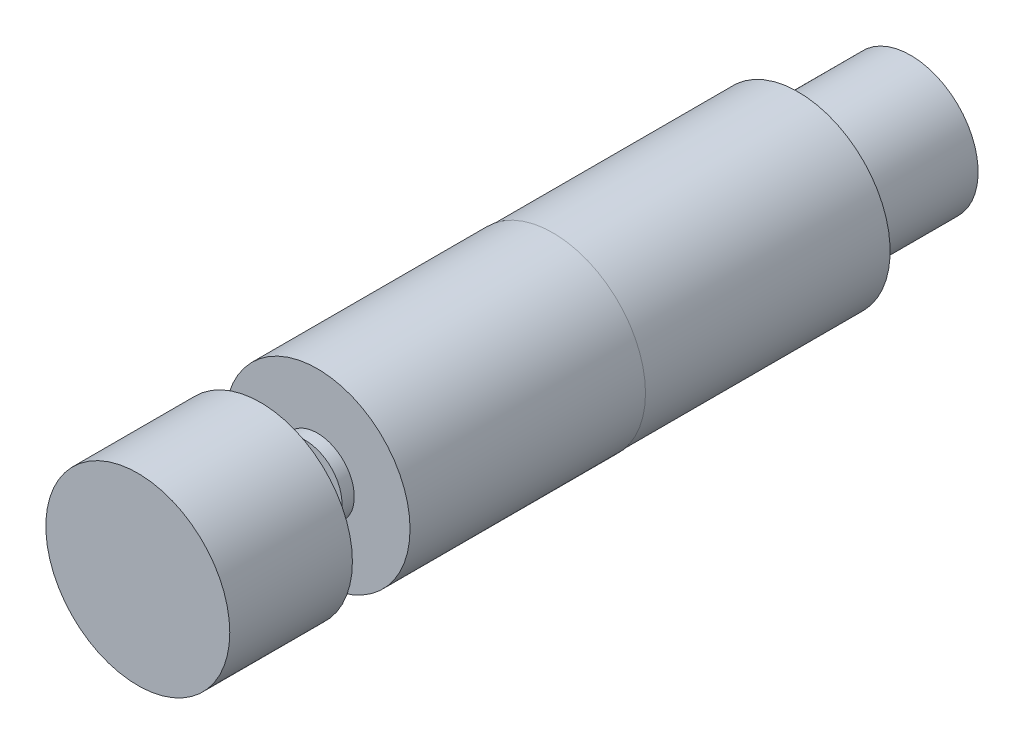
ISO-10303-21;
HEADER;
FILE_DESCRIPTION(('STEP AP214'),'2;1');
FILE_NAME('part.step','',(''),(''),'','','');
FILE_SCHEMA(('AUTOMOTIVE_DESIGN { 1 0 10303 214 1 1 1 1 }'));
ENDSEC;
DATA;
#1=APPLICATION_CONTEXT('core data for automotive mechanical design processes');
#2=APPLICATION_PROTOCOL_DEFINITION('international standard','automotive_design',2000,#1);
#3=PRODUCT_CONTEXT('',#1,'mechanical');
#4=PRODUCT('Part','Part','',(#3));
#5=PRODUCT_RELATED_PRODUCT_CATEGORY('part','',(#4));
#6=PRODUCT_DEFINITION_FORMATION('','',#4);
#7=PRODUCT_DEFINITION_CONTEXT('part definition',#1,'design');
#8=PRODUCT_DEFINITION('design','',#6,#7);
#9=PRODUCT_DEFINITION_SHAPE('','',#8);
#10=(LENGTH_UNIT() NAMED_UNIT(*) SI_UNIT(.MILLI.,.METRE.));
#11=(NAMED_UNIT(*) PLANE_ANGLE_UNIT() SI_UNIT($,.RADIAN.));
#12=(NAMED_UNIT(*) SI_UNIT($,.STERADIAN.) SOLID_ANGLE_UNIT());
#13=UNCERTAINTY_MEASURE_WITH_UNIT(LENGTH_MEASURE(1.E-05),#10,'distance_accuracy_value','');
#14=(GEOMETRIC_REPRESENTATION_CONTEXT(3) GLOBAL_UNCERTAINTY_ASSIGNED_CONTEXT((#13)) GLOBAL_UNIT_ASSIGNED_CONTEXT((#10,
#11,#12)) REPRESENTATION_CONTEXT('',''));
#15=CARTESIAN_POINT('',(0.,0.,0.));
#16=DIRECTION('',(0.,0.,1.));
#17=DIRECTION('',(1.,0.,0.));
#18=AXIS2_PLACEMENT_3D('',#15,#16,#17);
#19=CARTESIAN_POINT('',(0.,0.,57.7));
#20=DIRECTION('',(0.,0.,-1.));
#21=DIRECTION('',(-1.,0.,0.));
#22=AXIS2_PLACEMENT_3D('',#19,#20,#21);
#23=CYLINDRICAL_SURFACE('',#22,3.);
#24=CARTESIAN_POINT('',(0.,0.,40.4));
#25=DIRECTION('',(0.,0.,1.));
#26=DIRECTION('',(1.,0.,0.));
#27=AXIS2_PLACEMENT_3D('',#24,#25,#26);
#28=CIRCLE('',#27,3.);
#29=CARTESIAN_POINT('',(3.,0.,40.4));
#30=VERTEX_POINT('',#29);
#31=EDGE_CURVE('E54',#30,#30,#28,.T.);
#32=ORIENTED_EDGE('',*,*,#31,.T.);
#33=EDGE_LOOP('',(#32));
#34=FACE_BOUND('',#33,.T.);
#35=CARTESIAN_POINT('',(0.,0.,47.7));
#36=DIRECTION('',(0.,0.,1.));
#37=DIRECTION('',(1.,0.,0.));
#38=AXIS2_PLACEMENT_3D('',#35,#36,#37);
#39=CIRCLE('',#38,3.);
#40=CARTESIAN_POINT('',(3.,0.,47.7));
#41=VERTEX_POINT('',#40);
#42=EDGE_CURVE('E11',#41,#41,#39,.T.);
#43=ORIENTED_EDGE('',*,*,#42,.F.);
#44=EDGE_LOOP('',(#43));
#45=FACE_BOUND('',#44,.T.);
#46=ADVANCED_FACE('F48',(#34,#45),#23,.T.);
#47=CARTESIAN_POINT('',(0.,0.,40.4));
#48=DIRECTION('',(0.,0.,1.));
#49=DIRECTION('',(1.,0.,0.));
#50=AXIS2_PLACEMENT_3D('',#47,#48,#49);
#51=PLANE('',#50);
#52=ORIENTED_EDGE('',*,*,#31,.F.);
#53=EDGE_LOOP('',(#52));
#54=FACE_BOUND('',#53,.T.);
#55=ADVANCED_FACE('F80',(#54),#51,.F.);
#56=CARTESIAN_POINT('',(0.,0.,67.7));
#57=DIRECTION('',(0.,0.,-1.));
#58=DIRECTION('',(-1.,0.,0.));
#59=AXIS2_PLACEMENT_3D('',#56,#57,#58);
#60=CYLINDRICAL_SURFACE('',#59,15.);
#61=CARTESIAN_POINT('',(0.,0.,67.7));
#62=DIRECTION('',(0.,0.,1.));
#63=DIRECTION('',(1.,0.,0.));
#64=AXIS2_PLACEMENT_3D('',#61,#62,#63);
#65=CIRCLE('',#64,15.);
#66=CARTESIAN_POINT('',(15.,0.,67.7));
#67=VERTEX_POINT('',#66);
#68=EDGE_CURVE('E58',#67,#67,#65,.T.);
#69=ORIENTED_EDGE('',*,*,#68,.F.);
#70=EDGE_LOOP('',(#69));
#71=FACE_BOUND('',#70,.T.);
#72=CARTESIAN_POINT('',(0.,0.,47.7));
#73=DIRECTION('',(0.,0.,1.));
#74=DIRECTION('',(1.,0.,0.));
#75=AXIS2_PLACEMENT_3D('',#72,#73,#74);
#76=CIRCLE('',#75,15.);
#77=CARTESIAN_POINT('',(15.,0.,47.7));
#78=VERTEX_POINT('',#77);
#79=EDGE_CURVE('E62',#78,#78,#76,.T.);
#80=ORIENTED_EDGE('',*,*,#79,.T.);
#81=EDGE_LOOP('',(#80));
#82=FACE_BOUND('',#81,.T.);
#83=ADVANCED_FACE('F68',(#71,#82),#60,.T.);
#84=CARTESIAN_POINT('',(0.,0.,67.7));
#85=DIRECTION('',(0.,0.,1.));
#86=DIRECTION('',(1.,0.,0.));
#87=AXIS2_PLACEMENT_3D('',#84,#85,#86);
#88=PLANE('',#87);
#89=ORIENTED_EDGE('',*,*,#68,.T.);
#90=EDGE_LOOP('',(#89));
#91=FACE_BOUND('',#90,.T.);
#92=ADVANCED_FACE('F72',(#91),#88,.T.);
#93=CARTESIAN_POINT('',(0.,0.,47.7));
#94=DIRECTION('',(0.,0.,1.));
#95=DIRECTION('',(1.,0.,0.));
#96=AXIS2_PLACEMENT_3D('',#93,#94,#95);
#97=PLANE('',#96);
#98=ORIENTED_EDGE('',*,*,#42,.T.);
#99=EDGE_LOOP('',(#98));
#100=FACE_BOUND('',#99,.T.);
#101=ORIENTED_EDGE('',*,*,#79,.F.);
#102=EDGE_LOOP('',(#101));
#103=FACE_BOUND('',#102,.T.);
#104=ADVANCED_FACE('F70',(#100,#103),#97,.F.);
#105=CLOSED_SHELL('',(#46,#55,#83,#92,#104));
#106=MANIFOLD_SOLID_BREP('B2',#105);
#107=CARTESIAN_POINT('',(0.,0.,-58.35));
#108=DIRECTION('',(0.,0.,1.));
#109=DIRECTION('',(1.,0.,0.));
#110=AXIS2_PLACEMENT_3D('',#107,#108,#109);
#111=CYLINDRICAL_SURFACE('',#110,11.);
#112=CARTESIAN_POINT('',(0.,0.,-58.35));
#113=DIRECTION('',(0.,0.,-1.));
#114=DIRECTION('',(-1.,0.,0.));
#115=AXIS2_PLACEMENT_3D('',#112,#113,#114);
#116=CIRCLE('',#115,11.);
#117=CARTESIAN_POINT('',(-11.,0.,-58.35));
#118=VERTEX_POINT('',#117);
#119=EDGE_CURVE('E47',#118,#118,#116,.T.);
#120=ORIENTED_EDGE('',*,*,#119,.F.);
#121=EDGE_LOOP('',(#120));
#122=FACE_BOUND('',#121,.T.);
#123=CARTESIAN_POINT('',(0.,0.,-40.));
#124=DIRECTION('',(0.,0.,-1.));
#125=DIRECTION('',(-1.,0.,0.));
#126=AXIS2_PLACEMENT_3D('',#123,#124,#125);
#127=CIRCLE('',#126,11.);
#128=CARTESIAN_POINT('',(-11.,0.,-40.));
#129=VERTEX_POINT('',#128);
#130=EDGE_CURVE('E135',#129,#129,#127,.T.);
#131=ORIENTED_EDGE('',*,*,#130,.T.);
#132=EDGE_LOOP('',(#131));
#133=FACE_BOUND('',#132,.T.);
#134=ADVANCED_FACE('F132',(#122,#133),#111,.T.);
#135=CARTESIAN_POINT('',(0.,0.,-58.35));
#136=DIRECTION('',(0.,0.,-1.));
#137=DIRECTION('',(-1.,0.,0.));
#138=AXIS2_PLACEMENT_3D('',#135,#136,#137);
#139=PLANE('',#138);
#140=ORIENTED_EDGE('',*,*,#119,.T.);
#141=EDGE_LOOP('',(#140));
#142=FACE_BOUND('',#141,.T.);
#143=ADVANCED_FACE('F147',(#142),#139,.T.);
#144=CARTESIAN_POINT('',(0.,0.,-40.));
#145=DIRECTION('',(0.,0.,-1.));
#146=DIRECTION('',(-1.,0.,0.));
#147=AXIS2_PLACEMENT_3D('',#144,#145,#146);
#148=PLANE('',#147);
#149=ORIENTED_EDGE('',*,*,#130,.F.);
#150=EDGE_LOOP('',(#149));
#151=FACE_BOUND('',#150,.T.);
#152=ADVANCED_FACE('F145',(#151),#148,.F.);
#153=CLOSED_SHELL('',(#134,#143,#152));
#154=MANIFOLD_SOLID_BREP('B6',#153);
#155=CARTESIAN_POINT('',(0.,0.,-40.));
#156=DIRECTION('',(0.,0.,1.));
#157=DIRECTION('',(1.,0.,0.));
#158=AXIS2_PLACEMENT_3D('',#155,#156,#157);
#159=CYLINDRICAL_SURFACE('',#158,15.);
#160=CARTESIAN_POINT('',(0.,0.,-40.));
#161=DIRECTION('',(0.,0.,-1.));
#162=DIRECTION('',(-1.,0.,0.));
#163=AXIS2_PLACEMENT_3D('',#160,#161,#162);
#164=CIRCLE('',#163,15.);
#165=CARTESIAN_POINT('',(-15.,0.,-40.));
#166=VERTEX_POINT('',#165);
#167=EDGE_CURVE('E131',#166,#166,#164,.T.);
#168=ORIENTED_EDGE('',*,*,#167,.F.);
#169=EDGE_LOOP('',(#168));
#170=FACE_BOUND('',#169,.T.);
#171=CARTESIAN_POINT('',(0.,0.,0.));
#172=DIRECTION('',(0.,0.,-1.));
#173=DIRECTION('',(-1.,0.,0.));
#174=AXIS2_PLACEMENT_3D('',#171,#172,#173);
#175=CIRCLE('',#174,15.);
#176=CARTESIAN_POINT('',(-15.,0.,0.));
#177=VERTEX_POINT('',#176);
#178=EDGE_CURVE('E182',#177,#177,#175,.T.);
#179=ORIENTED_EDGE('',*,*,#178,.T.);
#180=EDGE_LOOP('',(#179));
#181=FACE_BOUND('',#180,.T.);
#182=ADVANCED_FACE('F179',(#170,#181),#159,.T.);
#183=CARTESIAN_POINT('',(0.,0.,-40.));
#184=DIRECTION('',(0.,0.,-1.));
#185=DIRECTION('',(-1.,0.,0.));
#186=AXIS2_PLACEMENT_3D('',#183,#184,#185);
#187=PLANE('',#186);
#188=ORIENTED_EDGE('',*,*,#167,.T.);
#189=EDGE_LOOP('',(#188));
#190=FACE_BOUND('',#189,.T.);
#191=ADVANCED_FACE('F194',(#190),#187,.T.);
#192=CARTESIAN_POINT('',(0.,0.,0.));
#193=DIRECTION('',(0.,0.,-1.));
#194=DIRECTION('',(-1.,0.,0.));
#195=AXIS2_PLACEMENT_3D('',#192,#193,#194);
#196=PLANE('',#195);
#197=ORIENTED_EDGE('',*,*,#178,.F.);
#198=EDGE_LOOP('',(#197));
#199=FACE_BOUND('',#198,.T.);
#200=ADVANCED_FACE('F192',(#199),#196,.F.);
#201=CLOSED_SHELL('',(#182,#191,#200));
#202=MANIFOLD_SOLID_BREP('B42',#201);
#203=CARTESIAN_POINT('',(0.,0.,38.4));
#204=DIRECTION('',(0.,0.,-1.));
#205=DIRECTION('',(-1.,0.,0.));
#206=AXIS2_PLACEMENT_3D('',#203,#204,#205);
#207=CYLINDRICAL_SURFACE('',#206,15.1);
#208=CARTESIAN_POINT('',(0.,0.,38.4));
#209=DIRECTION('',(0.,0.,1.));
#210=DIRECTION('',(1.,0.,0.));
#211=AXIS2_PLACEMENT_3D('',#208,#209,#210);
#212=CIRCLE('',#211,15.1);
#213=CARTESIAN_POINT('',(15.1,0.,38.4));
#214=VERTEX_POINT('',#213);
#215=EDGE_CURVE('E226',#214,#214,#212,.T.);
#216=ORIENTED_EDGE('',*,*,#215,.F.);
#217=EDGE_LOOP('',(#216));
#218=FACE_BOUND('',#217,.T.);
#219=CARTESIAN_POINT('',(0.,0.,0.));
#220=DIRECTION('',(0.,0.,1.));
#221=DIRECTION('',(1.,0.,0.));
#222=AXIS2_PLACEMENT_3D('',#219,#220,#221);
#223=CIRCLE('',#222,15.1);
#224=CARTESIAN_POINT('',(15.1,0.,0.));
#225=VERTEX_POINT('',#224);
#226=EDGE_CURVE('E222',#225,#225,#223,.T.);
#227=ORIENTED_EDGE('',*,*,#226,.T.);
#228=EDGE_LOOP('',(#227));
#229=FACE_BOUND('',#228,.T.);
#230=ADVANCED_FACE('F219',(#218,#229),#207,.T.);
#231=CARTESIAN_POINT('',(0.,0.,38.4));
#232=DIRECTION('',(0.,0.,1.));
#233=DIRECTION('',(1.,0.,0.));
#234=AXIS2_PLACEMENT_3D('',#231,#232,#233);
#235=PLANE('',#234);
#236=CARTESIAN_POINT('',(0.,0.,38.4));
#237=DIRECTION('',(0.,0.,1.));
#238=DIRECTION('',(1.,0.,0.));
#239=AXIS2_PLACEMENT_3D('',#236,#237,#238);
#240=CIRCLE('',#239,6.);
#241=CARTESIAN_POINT('',(6.,0.,38.4));
#242=VERTEX_POINT('',#241);
#243=EDGE_CURVE('E178',#242,#242,#240,.T.);
#244=ORIENTED_EDGE('',*,*,#243,.F.);
#245=EDGE_LOOP('',(#244));
#246=FACE_BOUND('',#245,.T.);
#247=ORIENTED_EDGE('',*,*,#215,.T.);
#248=EDGE_LOOP('',(#247));
#249=FACE_BOUND('',#248,.T.);
#250=ADVANCED_FACE('F243',(#246,#249),#235,.T.);
#251=CARTESIAN_POINT('',(0.,0.,0.));
#252=DIRECTION('',(0.,0.,1.));
#253=DIRECTION('',(1.,0.,0.));
#254=AXIS2_PLACEMENT_3D('',#251,#252,#253);
#255=PLANE('',#254);
#256=ORIENTED_EDGE('',*,*,#226,.F.);
#257=EDGE_LOOP('',(#256));
#258=FACE_BOUND('',#257,.T.);
#259=ADVANCED_FACE('F240',(#258),#255,.F.);
#260=CARTESIAN_POINT('',(0.,0.,40.4));
#261=DIRECTION('',(0.,0.,-1.));
#262=DIRECTION('',(-1.,0.,0.));
#263=AXIS2_PLACEMENT_3D('',#260,#261,#262);
#264=CYLINDRICAL_SURFACE('',#263,6.);
#265=CARTESIAN_POINT('',(0.,0.,40.4));
#266=DIRECTION('',(0.,0.,1.));
#267=DIRECTION('',(1.,0.,0.));
#268=AXIS2_PLACEMENT_3D('',#265,#266,#267);
#269=CIRCLE('',#268,6.);
#270=CARTESIAN_POINT('',(6.,0.,40.4));
#271=VERTEX_POINT('',#270);
#272=EDGE_CURVE('E232',#271,#271,#269,.T.);
#273=ORIENTED_EDGE('',*,*,#272,.F.);
#274=EDGE_LOOP('',(#273));
#275=FACE_BOUND('',#274,.T.);
#276=ORIENTED_EDGE('',*,*,#243,.T.);
#277=EDGE_LOOP('',(#276));
#278=FACE_BOUND('',#277,.T.);
#279=ADVANCED_FACE('F242',(#275,#278),#264,.T.);
#280=CARTESIAN_POINT('',(0.,0.,40.4));
#281=DIRECTION('',(0.,0.,1.));
#282=DIRECTION('',(1.,0.,0.));
#283=AXIS2_PLACEMENT_3D('',#280,#281,#282);
#284=PLANE('',#283);
#285=ORIENTED_EDGE('',*,*,#272,.T.);
#286=EDGE_LOOP('',(#285));
#287=FACE_BOUND('',#286,.T.);
#288=ADVANCED_FACE('F248',(#287),#284,.T.);
#289=CLOSED_SHELL('',(#230,#250,#259,#279,#288));
#290=MANIFOLD_SOLID_BREP('B126',#289);
#291=ADVANCED_BREP_SHAPE_REPRESENTATION('',(#18,#106,#154,#202,#290),#14);
#292=SHAPE_DEFINITION_REPRESENTATION(#9,#291);
ENDSEC;
END-ISO-10303-21;
